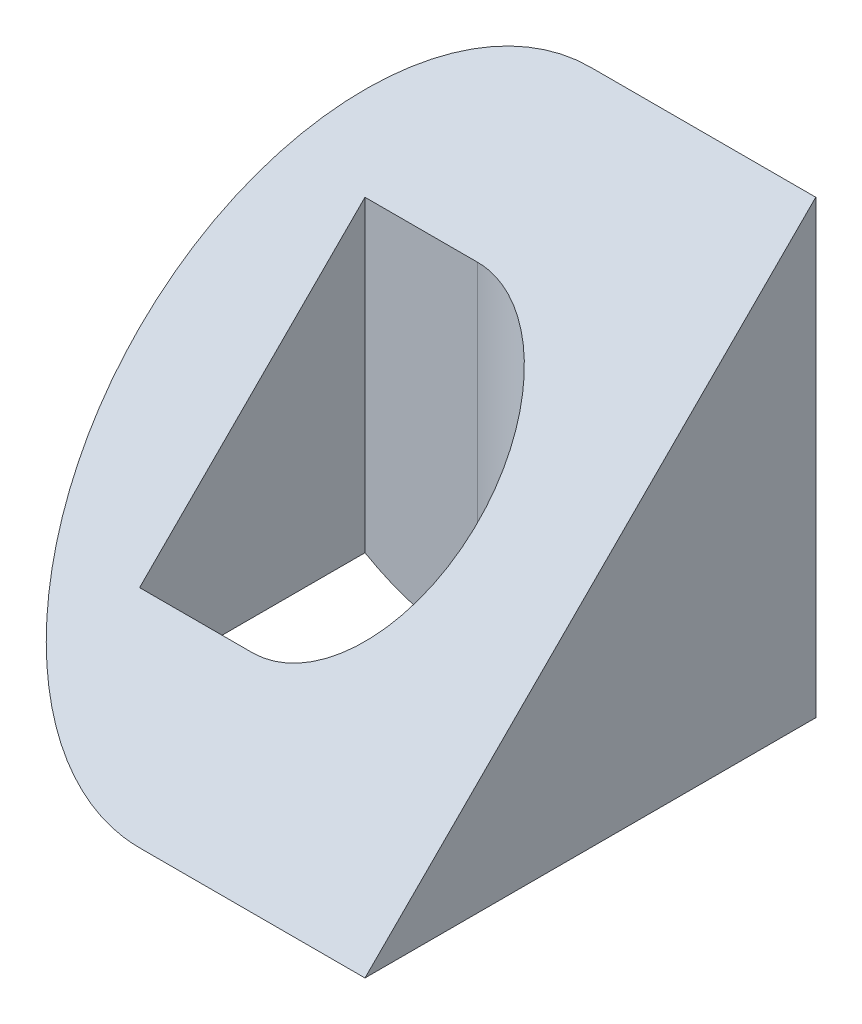
ISO-10303-21;
HEADER;
FILE_DESCRIPTION(('STEP AP214'),'2;1');
FILE_NAME('part.step','',(''),(''),'','','');
FILE_SCHEMA(('AUTOMOTIVE_DESIGN { 1 0 10303 214 1 1 1 1 }'));
ENDSEC;
DATA;
#1=APPLICATION_CONTEXT('core data for automotive mechanical design processes');
#2=APPLICATION_PROTOCOL_DEFINITION('international standard','automotive_design',2000,#1);
#3=PRODUCT_CONTEXT('',#1,'mechanical');
#4=PRODUCT('Part','Part','',(#3));
#5=PRODUCT_RELATED_PRODUCT_CATEGORY('part','',(#4));
#6=PRODUCT_DEFINITION_FORMATION('','',#4);
#7=PRODUCT_DEFINITION_CONTEXT('part definition',#1,'design');
#8=PRODUCT_DEFINITION('design','',#6,#7);
#9=PRODUCT_DEFINITION_SHAPE('','',#8);
#10=(LENGTH_UNIT() NAMED_UNIT(*) SI_UNIT(.MILLI.,.METRE.));
#11=(NAMED_UNIT(*) PLANE_ANGLE_UNIT() SI_UNIT($,.RADIAN.));
#12=(NAMED_UNIT(*) SI_UNIT($,.STERADIAN.) SOLID_ANGLE_UNIT());
#13=UNCERTAINTY_MEASURE_WITH_UNIT(LENGTH_MEASURE(1.E-05),#10,'distance_accuracy_value','');
#14=(GEOMETRIC_REPRESENTATION_CONTEXT(3) GLOBAL_UNCERTAINTY_ASSIGNED_CONTEXT((#13)) GLOBAL_UNIT_ASSIGNED_CONTEXT((#10,
#11,#12)) REPRESENTATION_CONTEXT('',''));
#15=CARTESIAN_POINT('',(0.,0.,0.));
#16=DIRECTION('',(0.,0.,1.));
#17=DIRECTION('',(1.,0.,0.));
#18=AXIS2_PLACEMENT_3D('',#15,#16,#17);
#19=CARTESIAN_POINT('',(60.,0.,60.));
#20=DIRECTION('',(-1.,0.,0.));
#21=DIRECTION('',(0.,0.,1.));
#22=AXIS2_PLACEMENT_3D('',#19,#20,#21);
#23=PLANE('',#22);
#24=DIRECTION('',(0.,0.707106781186548,-0.707106781186548));
#25=VECTOR('',#24,1.);
#26=CARTESIAN_POINT('',(60.,30.,30.));
#27=LINE('',#26,#25);
#28=CARTESIAN_POINT('',(60.,0.,60.));
#29=VERTEX_POINT('',#28);
#30=CARTESIAN_POINT('',(60.,60.,0.));
#31=VERTEX_POINT('',#30);
#32=EDGE_CURVE('E184',#29,#31,#27,.T.);
#33=ORIENTED_EDGE('',*,*,#32,.F.);
#34=DIRECTION('',(0.,0.,-1.));
#35=VECTOR('',#34,1.);
#36=CARTESIAN_POINT('',(60.,0.,60.));
#37=LINE('',#36,#35);
#38=CARTESIAN_POINT('',(60.,0.,0.));
#39=VERTEX_POINT('',#38);
#40=EDGE_CURVE('E154',#29,#39,#37,.T.);
#41=ORIENTED_EDGE('',*,*,#40,.T.);
#42=DIRECTION('',(0.,1.,0.));
#43=VECTOR('',#42,1.);
#44=CARTESIAN_POINT('',(60.,0.,0.));
#45=LINE('',#44,#43);
#46=EDGE_CURVE('E157',#39,#31,#45,.T.);
#47=ORIENTED_EDGE('',*,*,#46,.T.);
#48=EDGE_LOOP('',(#33,#41,#47));
#49=FACE_BOUND('',#48,.T.);
#50=ADVANCED_FACE('F51',(#49),#23,.F.);
#51=CARTESIAN_POINT('',(30.,30.,0.));
#52=DIRECTION('',(0.,0.,1.));
#53=DIRECTION('',(1.,0.,0.));
#54=AXIS2_PLACEMENT_3D('',#51,#52,#53);
#55=CYLINDRICAL_SURFACE('',#54,30.);
#56=CARTESIAN_POINT('',(30.,30.,15.));
#57=DIRECTION('',(0.,0.,-1.));
#58=DIRECTION('',(-1.,0.,0.));
#59=AXIS2_PLACEMENT_3D('',#56,#57,#58);
#60=CIRCLE('',#59,30.);
#61=CARTESIAN_POINT('',(15.,4.01923788646684,15.));
#62=VERTEX_POINT('',#61);
#63=CARTESIAN_POINT('',(30.,0.,15.));
#64=VERTEX_POINT('',#63);
#65=EDGE_CURVE('E139',#62,#64,#60,.F.);
#66=ORIENTED_EDGE('',*,*,#65,.F.);
#67=DIRECTION('',(0.,0.,1.));
#68=VECTOR('',#67,1.);
#69=CARTESIAN_POINT('',(15.,4.01923788646684,0.));
#70=LINE('',#69,#68);
#71=CARTESIAN_POINT('',(15.,4.01923788646684,45.));
#72=VERTEX_POINT('',#71);
#73=EDGE_CURVE('E138',#72,#62,#70,.F.);
#74=ORIENTED_EDGE('',*,*,#73,.F.);
#75=CARTESIAN_POINT('',(30.,30.,45.));
#76=DIRECTION('',(0.,0.,1.));
#77=DIRECTION('',(1.,0.,0.));
#78=AXIS2_PLACEMENT_3D('',#75,#76,#77);
#79=CIRCLE('',#78,30.);
#80=CARTESIAN_POINT('',(30.,0.,45.));
#81=VERTEX_POINT('',#80);
#82=EDGE_CURVE('E116',#81,#72,#79,.F.);
#83=ORIENTED_EDGE('',*,*,#82,.F.);
#84=DIRECTION('',(0.,0.,1.));
#85=VECTOR('',#84,1.);
#86=CARTESIAN_POINT('',(30.,0.,0.));
#87=LINE('',#86,#85);
#88=CARTESIAN_POINT('',(30.,0.,60.));
#89=VERTEX_POINT('',#88);
#90=EDGE_CURVE('E136',#81,#89,#87,.T.);
#91=ORIENTED_EDGE('',*,*,#90,.T.);
#92=CARTESIAN_POINT('',(30.,30.,30.));
#93=DIRECTION('',(0.,0.707106781186547,0.707106781186547));
#94=DIRECTION('',(0.,-0.707106781186547,0.707106781186547));
#95=AXIS2_PLACEMENT_3D('',#92,#93,#94);
#96=ELLIPSE('',#95,42.4264068711928,30.);
#97=CARTESIAN_POINT('',(0.,30.,30.));
#98=VERTEX_POINT('',#97);
#99=EDGE_CURVE('E149',#89,#98,#96,.F.);
#100=ORIENTED_EDGE('',*,*,#99,.T.);
#101=CARTESIAN_POINT('',(30.,30.,30.));
#102=DIRECTION('',(0.,-0.707106781186547,0.707106781186547));
#103=DIRECTION('',(0.,0.707106781186547,0.707106781186547));
#104=AXIS2_PLACEMENT_3D('',#101,#102,#103);
#105=ELLIPSE('',#104,42.4264068711928,30.);
#106=CARTESIAN_POINT('',(30.,0.,0.));
#107=VERTEX_POINT('',#106);
#108=EDGE_CURVE('E163',#98,#107,#105,.T.);
#109=ORIENTED_EDGE('',*,*,#108,.T.);
#110=EDGE_CURVE('E144',#107,#64,#87,.T.);
#111=ORIENTED_EDGE('',*,*,#110,.T.);
#112=EDGE_LOOP('',(#66,#74,#83,#91,#100,#109,#111));
#113=FACE_BOUND('',#112,.T.);
#114=ADVANCED_FACE('F134',(#113),#55,.T.);
#115=CARTESIAN_POINT('',(0.,0.,0.));
#116=DIRECTION('',(0.,0.,-1.));
#117=DIRECTION('',(-1.,0.,0.));
#118=AXIS2_PLACEMENT_3D('',#115,#116,#117);
#119=PLANE('',#118);
#120=DIRECTION('',(1.,0.,0.));
#121=VECTOR('',#120,1.);
#122=CARTESIAN_POINT('',(0.,0.,0.));
#123=LINE('',#122,#121);
#124=EDGE_CURVE('E147',#107,#39,#123,.T.);
#125=ORIENTED_EDGE('',*,*,#124,.F.);
#126=DIRECTION('',(0.,1.,0.));
#127=VECTOR('',#126,1.);
#128=CARTESIAN_POINT('',(30.,0.,0.));
#129=LINE('',#128,#127);
#130=CARTESIAN_POINT('',(30.,60.,0.));
#131=VERTEX_POINT('',#130);
#132=EDGE_CURVE('E145',#107,#131,#129,.T.);
#133=ORIENTED_EDGE('',*,*,#132,.T.);
#134=DIRECTION('',(-1.,0.,0.));
#135=VECTOR('',#134,1.);
#136=CARTESIAN_POINT('',(0.,60.,0.));
#137=LINE('',#136,#135);
#138=EDGE_CURVE('E155',#31,#131,#137,.T.);
#139=ORIENTED_EDGE('',*,*,#138,.F.);
#140=ORIENTED_EDGE('',*,*,#46,.F.);
#141=EDGE_LOOP('',(#125,#133,#139,#140));
#142=FACE_BOUND('',#141,.T.);
#143=ADVANCED_FACE('F192',(#142),#119,.T.);
#144=CARTESIAN_POINT('',(0.,0.,60.));
#145=DIRECTION('',(0.,1.,0.));
#146=DIRECTION('',(0.,0.,1.));
#147=AXIS2_PLACEMENT_3D('',#144,#145,#146);
#148=PLANE('',#147);
#149=ORIENTED_EDGE('',*,*,#90,.F.);
#150=CARTESIAN_POINT('',(30.,0.,30.));
#151=DIRECTION('',(0.,1.,0.));
#152=DIRECTION('',(0.,0.,-1.));
#153=AXIS2_PLACEMENT_3D('',#150,#151,#152);
#154=CIRCLE('',#153,15.);
#155=EDGE_CURVE('E124',#81,#64,#154,.T.);
#156=ORIENTED_EDGE('',*,*,#155,.T.);
#157=ORIENTED_EDGE('',*,*,#110,.F.);
#158=ORIENTED_EDGE('',*,*,#124,.T.);
#159=ORIENTED_EDGE('',*,*,#40,.F.);
#160=DIRECTION('',(1.,0.,0.));
#161=VECTOR('',#160,1.);
#162=CARTESIAN_POINT('',(0.,0.,60.));
#163=LINE('',#162,#161);
#164=EDGE_CURVE('E143',#89,#29,#163,.T.);
#165=ORIENTED_EDGE('',*,*,#164,.F.);
#166=EDGE_LOOP('',(#149,#156,#157,#158,#159,#165));
#167=FACE_BOUND('',#166,.T.);
#168=ADVANCED_FACE('F53',(#167),#148,.F.);
#169=CARTESIAN_POINT('',(30.,0.,30.));
#170=DIRECTION('',(0.,1.,0.));
#171=DIRECTION('',(0.,0.,1.));
#172=AXIS2_PLACEMENT_3D('',#169,#170,#171);
#173=CYLINDRICAL_SURFACE('',#172,30.);
#174=ORIENTED_EDGE('',*,*,#132,.F.);
#175=ORIENTED_EDGE('',*,*,#108,.F.);
#176=CARTESIAN_POINT('',(30.,30.,30.));
#177=DIRECTION('',(0.,0.707106781186547,0.707106781186547));
#178=DIRECTION('',(0.,-0.707106781186547,0.707106781186547));
#179=AXIS2_PLACEMENT_3D('',#176,#177,#178);
#180=ELLIPSE('',#179,42.4264068711928,30.);
#181=EDGE_CURVE('E166',#131,#98,#180,.T.);
#182=ORIENTED_EDGE('',*,*,#181,.F.);
#183=EDGE_LOOP('',(#174,#175,#182));
#184=FACE_BOUND('',#183,.T.);
#185=ADVANCED_FACE('F188',(#184),#173,.T.);
#186=CARTESIAN_POINT('',(60.,30.,30.));
#187=DIRECTION('',(0.,0.707106781186547,0.707106781186547));
#188=DIRECTION('',(0.,-0.707106781186548,0.707106781186548));
#189=AXIS2_PLACEMENT_3D('',#186,#187,#188);
#190=PLANE('',#189);
#191=DIRECTION('',(-1.,0.,0.));
#192=VECTOR('',#191,1.);
#193=CARTESIAN_POINT('',(60.,45.,15.));
#194=LINE('',#193,#192);
#195=CARTESIAN_POINT('',(30.,45.,15.));
#196=VERTEX_POINT('',#195);
#197=CARTESIAN_POINT('',(15.,45.,15.));
#198=VERTEX_POINT('',#197);
#199=EDGE_CURVE('E12',#196,#198,#194,.T.);
#200=ORIENTED_EDGE('',*,*,#199,.F.);
#201=CARTESIAN_POINT('',(30.,30.,30.));
#202=DIRECTION('',(0.,0.707106781186547,0.707106781186547));
#203=DIRECTION('',(0.,0.707106781186548,-0.707106781186548));
#204=AXIS2_PLACEMENT_3D('',#201,#202,#203);
#205=ELLIPSE('',#204,21.2132034355964,15.);
#206=CARTESIAN_POINT('',(30.,15.,45.));
#207=VERTEX_POINT('',#206);
#208=EDGE_CURVE('E59',#207,#196,#205,.T.);
#209=ORIENTED_EDGE('',*,*,#208,.F.);
#210=DIRECTION('',(1.,0.,0.));
#211=VECTOR('',#210,1.);
#212=CARTESIAN_POINT('',(60.,15.,45.));
#213=LINE('',#212,#211);
#214=CARTESIAN_POINT('',(15.,15.,45.));
#215=VERTEX_POINT('',#214);
#216=EDGE_CURVE('E119',#215,#207,#213,.T.);
#217=ORIENTED_EDGE('',*,*,#216,.F.);
#218=DIRECTION('',(0.,-0.707106781186548,0.707106781186548));
#219=VECTOR('',#218,1.);
#220=CARTESIAN_POINT('',(15.,30.,30.));
#221=LINE('',#220,#219);
#222=EDGE_CURVE('E168',#198,#215,#221,.T.);
#223=ORIENTED_EDGE('',*,*,#222,.F.);
#224=EDGE_LOOP('',(#200,#209,#217,#223));
#225=FACE_BOUND('',#224,.T.);
#226=ORIENTED_EDGE('',*,*,#99,.F.);
#227=ORIENTED_EDGE('',*,*,#164,.T.);
#228=ORIENTED_EDGE('',*,*,#32,.T.);
#229=ORIENTED_EDGE('',*,*,#138,.T.);
#230=ORIENTED_EDGE('',*,*,#181,.T.);
#231=EDGE_LOOP('',(#226,#227,#228,#229,#230));
#232=FACE_BOUND('',#231,.T.);
#233=ADVANCED_FACE('F176',(#225,#232),#190,.T.);
#234=CARTESIAN_POINT('',(15.,0.,15.));
#235=DIRECTION('',(0.,0.,-1.));
#236=DIRECTION('',(-1.,0.,0.));
#237=AXIS2_PLACEMENT_3D('',#234,#235,#236);
#238=PLANE('',#237);
#239=ORIENTED_EDGE('',*,*,#65,.T.);
#240=DIRECTION('',(0.,1.,0.));
#241=VECTOR('',#240,1.);
#242=CARTESIAN_POINT('',(30.,0.,15.));
#243=LINE('',#242,#241);
#244=EDGE_CURVE('E66',#64,#196,#243,.T.);
#245=ORIENTED_EDGE('',*,*,#244,.T.);
#246=ORIENTED_EDGE('',*,*,#199,.T.);
#247=DIRECTION('',(0.,1.,0.));
#248=VECTOR('',#247,1.);
#249=CARTESIAN_POINT('',(15.,0.,15.));
#250=LINE('',#249,#248);
#251=EDGE_CURVE('E74',#62,#198,#250,.T.);
#252=ORIENTED_EDGE('',*,*,#251,.F.);
#253=EDGE_LOOP('',(#239,#245,#246,#252));
#254=FACE_BOUND('',#253,.T.);
#255=ADVANCED_FACE('F173',(#254),#238,.F.);
#256=CARTESIAN_POINT('',(30.,0.,30.));
#257=DIRECTION('',(0.,1.,0.));
#258=DIRECTION('',(0.,0.,1.));
#259=AXIS2_PLACEMENT_3D('',#256,#257,#258);
#260=CYLINDRICAL_SURFACE('',#259,15.);
#261=ORIENTED_EDGE('',*,*,#208,.T.);
#262=ORIENTED_EDGE('',*,*,#244,.F.);
#263=ORIENTED_EDGE('',*,*,#155,.F.);
#264=DIRECTION('',(0.,1.,0.));
#265=VECTOR('',#264,1.);
#266=CARTESIAN_POINT('',(30.,0.,45.));
#267=LINE('',#266,#265);
#268=EDGE_CURVE('E112',#81,#207,#267,.T.);
#269=ORIENTED_EDGE('',*,*,#268,.T.);
#270=EDGE_LOOP('',(#261,#262,#263,#269));
#271=FACE_BOUND('',#270,.T.);
#272=ADVANCED_FACE('F125',(#271),#260,.F.);
#273=CARTESIAN_POINT('',(15.,0.,45.));
#274=DIRECTION('',(0.,0.,1.));
#275=DIRECTION('',(1.,0.,0.));
#276=AXIS2_PLACEMENT_3D('',#273,#274,#275);
#277=PLANE('',#276);
#278=ORIENTED_EDGE('',*,*,#82,.T.);
#279=DIRECTION('',(0.,1.,0.));
#280=VECTOR('',#279,1.);
#281=CARTESIAN_POINT('',(15.,0.,45.));
#282=LINE('',#281,#280);
#283=EDGE_CURVE('E121',#72,#215,#282,.T.);
#284=ORIENTED_EDGE('',*,*,#283,.T.);
#285=ORIENTED_EDGE('',*,*,#216,.T.);
#286=ORIENTED_EDGE('',*,*,#268,.F.);
#287=EDGE_LOOP('',(#278,#284,#285,#286));
#288=FACE_BOUND('',#287,.T.);
#289=ADVANCED_FACE('F113',(#288),#277,.F.);
#290=CARTESIAN_POINT('',(15.,0.,15.));
#291=DIRECTION('',(-1.,0.,0.));
#292=DIRECTION('',(0.,0.,1.));
#293=AXIS2_PLACEMENT_3D('',#290,#291,#292);
#294=PLANE('',#293);
#295=ORIENTED_EDGE('',*,*,#73,.T.);
#296=ORIENTED_EDGE('',*,*,#251,.T.);
#297=ORIENTED_EDGE('',*,*,#222,.T.);
#298=ORIENTED_EDGE('',*,*,#283,.F.);
#299=EDGE_LOOP('',(#295,#296,#297,#298));
#300=FACE_BOUND('',#299,.T.);
#301=ADVANCED_FACE('F178',(#300),#294,.F.);
#302=CLOSED_SHELL('',(#50,#114,#143,#168,#185,#233,#255,#272,#289,#301));
#303=MANIFOLD_SOLID_BREP('B2',#302);
#304=ADVANCED_BREP_SHAPE_REPRESENTATION('',(#18,#303),#14);
#305=SHAPE_DEFINITION_REPRESENTATION(#9,#304);
ENDSEC;
END-ISO-10303-21;
